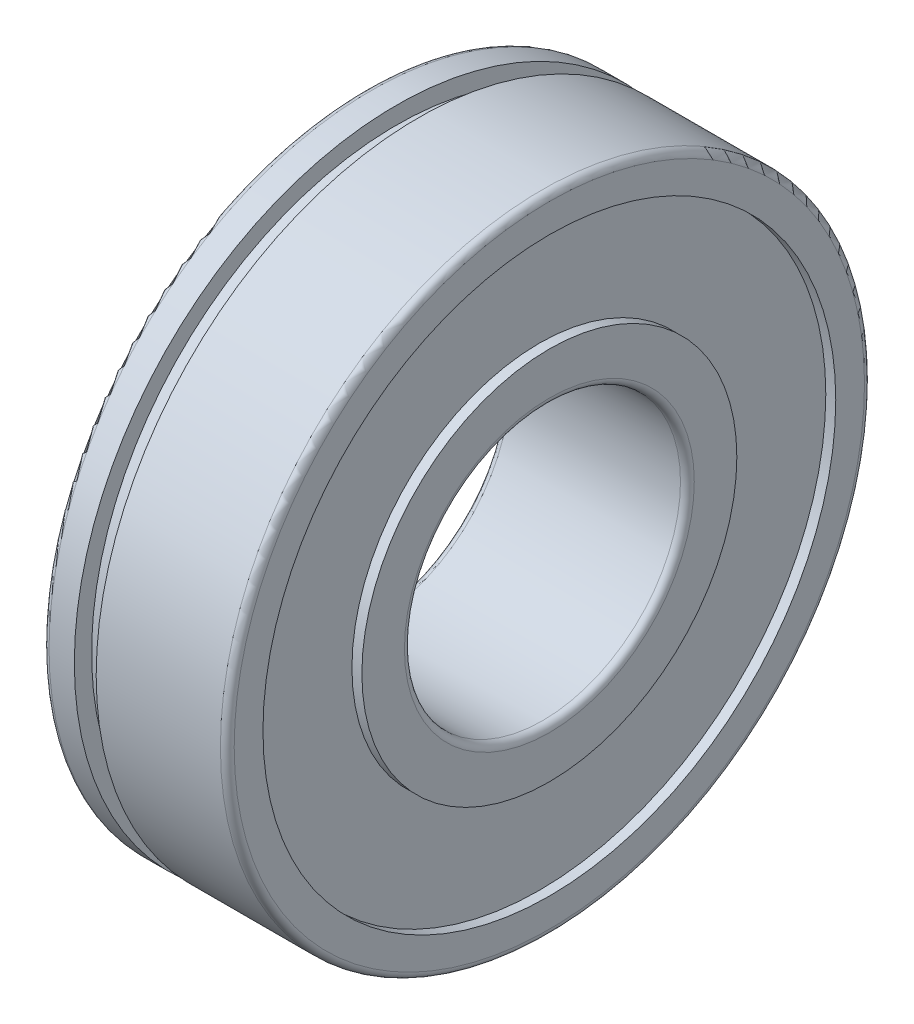
ISO-10303-21;
HEADER;
FILE_DESCRIPTION(('STEP AP214'),'2;1');
FILE_NAME('part.step','',(''),(''),'','','');
FILE_SCHEMA(('AUTOMOTIVE_DESIGN { 1 0 10303 214 1 1 1 1 }'));
ENDSEC;
DATA;
#1=APPLICATION_CONTEXT('core data for automotive mechanical design processes');
#2=APPLICATION_PROTOCOL_DEFINITION('international standard','automotive_design',2000,#1);
#3=PRODUCT_CONTEXT('',#1,'mechanical');
#4=PRODUCT('Part','Part','',(#3));
#5=PRODUCT_RELATED_PRODUCT_CATEGORY('part','',(#4));
#6=PRODUCT_DEFINITION_FORMATION('','',#4);
#7=PRODUCT_DEFINITION_CONTEXT('part definition',#1,'design');
#8=PRODUCT_DEFINITION('design','',#6,#7);
#9=PRODUCT_DEFINITION_SHAPE('','',#8);
#10=(LENGTH_UNIT() NAMED_UNIT(*) SI_UNIT(.MILLI.,.METRE.));
#11=(NAMED_UNIT(*) PLANE_ANGLE_UNIT() SI_UNIT($,.RADIAN.));
#12=(NAMED_UNIT(*) SI_UNIT($,.STERADIAN.) SOLID_ANGLE_UNIT());
#13=UNCERTAINTY_MEASURE_WITH_UNIT(LENGTH_MEASURE(1.E-05),#10,'distance_accuracy_value','');
#14=(GEOMETRIC_REPRESENTATION_CONTEXT(3) GLOBAL_UNCERTAINTY_ASSIGNED_CONTEXT((#13)) GLOBAL_UNIT_ASSIGNED_CONTEXT((#10,
#11,#12)) REPRESENTATION_CONTEXT('',''));
#15=CARTESIAN_POINT('',(0.,0.,0.));
#16=DIRECTION('',(0.,0.,1.));
#17=DIRECTION('',(1.,0.,0.));
#18=AXIS2_PLACEMENT_3D('',#15,#16,#17);
#19=CARTESIAN_POINT('',(0.,13.1000000000001,0.));
#20=DIRECTION('',(-1.,0.,0.));
#21=DIRECTION('',(0.,0.,1.));
#22=AXIS2_PLACEMENT_3D('',#19,#20,#21);
#23=PLANE('',#22);
#24=CARTESIAN_POINT('',(0.,0.,0.));
#25=DIRECTION('',(1.,0.,0.));
#26=DIRECTION('',(0.,0.,1.));
#27=AXIS2_PLACEMENT_3D('',#24,#25,#26);
#28=CIRCLE('',#27,13.7499999999997);
#29=CARTESIAN_POINT('',(0.,2.22044604925031E-13,13.7499999999997));
#30=VERTEX_POINT('',#29);
#31=CARTESIAN_POINT('',(0.,0.,-13.7499999999999));
#32=VERTEX_POINT('',#31);
#33=EDGE_CURVE('E75',#30,#32,#28,.T.);
#34=ORIENTED_EDGE('',*,*,#33,.F.);
#35=CARTESIAN_POINT('',(0.,0.,0.));
#36=DIRECTION('',(1.,0.,0.));
#37=DIRECTION('',(0.,1.,0.));
#38=AXIS2_PLACEMENT_3D('',#35,#36,#37);
#39=CIRCLE('',#38,13.7499999999997);
#40=CARTESIAN_POINT('',(0.,13.7500000000004,-8.88178419700125E-13));
#41=VERTEX_POINT('',#40);
#42=EDGE_CURVE('E68',#41,#30,#39,.T.);
#43=ORIENTED_EDGE('',*,*,#42,.F.);
#44=CARTESIAN_POINT('',(0.,0.,0.));
#45=DIRECTION('',(1.,0.,0.));
#46=DIRECTION('',(0.,0.,-1.));
#47=AXIS2_PLACEMENT_3D('',#44,#45,#46);
#48=CIRCLE('',#47,13.7499999999997);
#49=EDGE_CURVE('E72',#32,#41,#48,.T.);
#50=ORIENTED_EDGE('',*,*,#49,.F.);
#51=EDGE_LOOP('',(#34,#43,#50));
#52=FACE_BOUND('',#51,.T.);
#53=CARTESIAN_POINT('',(0.,0.,0.));
#54=DIRECTION('',(1.,0.,0.));
#55=DIRECTION('',(0.,0.,-1.));
#56=AXIS2_PLACEMENT_3D('',#53,#54,#55);
#57=CIRCLE('',#56,12.45);
#58=CARTESIAN_POINT('',(0.,0.,-12.45));
#59=VERTEX_POINT('',#58);
#60=EDGE_CURVE('E128',#59,#59,#57,.T.);
#61=ORIENTED_EDGE('',*,*,#60,.T.);
#62=EDGE_LOOP('',(#61));
#63=FACE_BOUND('',#62,.T.);
#64=ADVANCED_FACE('F18',(#52,#63),#23,.T.);
#65=CARTESIAN_POINT('',(0.25,0.,0.));
#66=DIRECTION('',(-1.,0.,0.));
#67=DIRECTION('',(0.,0.,1.));
#68=AXIS2_PLACEMENT_3D('',#65,#66,#67);
#69=TOROIDAL_SURFACE('',#68,13.7499999999997,0.249999999999998);
#70=ORIENTED_EDGE('',*,*,#42,.T.);
#71=ORIENTED_EDGE('',*,*,#33,.T.);
#72=ORIENTED_EDGE('',*,*,#49,.T.);
#73=EDGE_LOOP('',(#70,#71,#72));
#74=FACE_BOUND('',#73,.T.);
#75=CARTESIAN_POINT('',(0.25,0.,0.));
#76=DIRECTION('',(1.,0.,0.));
#77=DIRECTION('',(0.,0.,-1.));
#78=AXIS2_PLACEMENT_3D('',#75,#76,#77);
#79=CIRCLE('',#78,14.);
#80=CARTESIAN_POINT('',(0.25,0.,-14.0000000000001));
#81=VERTEX_POINT('',#80);
#82=EDGE_CURVE('E108',#81,#81,#79,.T.);
#83=ORIENTED_EDGE('',*,*,#82,.F.);
#84=EDGE_LOOP('',(#83));
#85=FACE_BOUND('',#84,.T.);
#86=ADVANCED_FACE('F81',(#74,#85),#69,.T.);
#87=CARTESIAN_POINT('',(0.216500000000001,0.,0.));
#88=DIRECTION('',(1.,0.,0.));
#89=DIRECTION('',(0.,0.,-1.));
#90=AXIS2_PLACEMENT_3D('',#87,#88,#89);
#91=CYLINDRICAL_SURFACE('',#90,12.45);
#92=CARTESIAN_POINT('',(0.433000000000003,0.,0.));
#93=DIRECTION('',(1.,0.,0.));
#94=DIRECTION('',(0.,0.,-1.));
#95=AXIS2_PLACEMENT_3D('',#92,#93,#94);
#96=CIRCLE('',#95,12.45);
#97=CARTESIAN_POINT('',(0.433000000000003,0.,-12.45));
#98=VERTEX_POINT('',#97);
#99=EDGE_CURVE('E127',#98,#98,#96,.F.);
#100=ORIENTED_EDGE('',*,*,#99,.F.);
#101=EDGE_LOOP('',(#100));
#102=FACE_BOUND('',#101,.T.);
#103=ORIENTED_EDGE('',*,*,#60,.F.);
#104=EDGE_LOOP('',(#103));
#105=FACE_BOUND('',#104,.T.);
#106=ADVANCED_FACE('F101',(#102,#105),#91,.F.);
#107=CARTESIAN_POINT('',(3.975,0.,0.));
#108=DIRECTION('',(1.,0.,0.));
#109=DIRECTION('',(0.,0.,-1.));
#110=AXIS2_PLACEMENT_3D('',#107,#108,#109);
#111=CYLINDRICAL_SURFACE('',#110,14.);
#112=ORIENTED_EDGE('',*,*,#82,.T.);
#113=EDGE_LOOP('',(#112));
#114=FACE_BOUND('',#113,.T.);
#115=CARTESIAN_POINT('',(1.35,0.,0.));
#116=DIRECTION('',(1.,0.,0.));
#117=DIRECTION('',(0.,0.,-1.));
#118=AXIS2_PLACEMENT_3D('',#115,#116,#117);
#119=CIRCLE('',#118,14.);
#120=CARTESIAN_POINT('',(1.35,0.,-14.0000000000001));
#121=VERTEX_POINT('',#120);
#122=EDGE_CURVE('E227',#121,#121,#119,.F.);
#123=ORIENTED_EDGE('',*,*,#122,.T.);
#124=EDGE_LOOP('',(#123));
#125=FACE_BOUND('',#124,.T.);
#126=ADVANCED_FACE('F537',(#114,#125),#111,.T.);
#127=CARTESIAN_POINT('',(0.433000000000003,10.3000000000002,-8.88178419700125E-13));
#128=DIRECTION('',(-1.,0.,0.));
#129=DIRECTION('',(0.,0.,1.));
#130=AXIS2_PLACEMENT_3D('',#127,#128,#129);
#131=PLANE('',#130);
#132=ORIENTED_EDGE('',*,*,#99,.T.);
#133=EDGE_LOOP('',(#132));
#134=FACE_BOUND('',#133,.T.);
#135=CARTESIAN_POINT('',(0.433000000000003,0.,0.));
#136=DIRECTION('',(1.,0.,0.));
#137=DIRECTION('',(0.,0.,-1.));
#138=AXIS2_PLACEMENT_3D('',#135,#136,#137);
#139=CIRCLE('',#138,8.15);
#140=CARTESIAN_POINT('',(0.433000000000003,0.,-8.15000000000003));
#141=VERTEX_POINT('',#140);
#142=EDGE_CURVE('E224',#141,#141,#139,.F.);
#143=ORIENTED_EDGE('',*,*,#142,.F.);
#144=EDGE_LOOP('',(#143));
#145=FACE_BOUND('',#144,.T.);
#146=ADVANCED_FACE('F528',(#134,#145),#131,.T.);
#147=CARTESIAN_POINT('',(1.35,15.7500000000006,2.22044604925031E-13));
#148=DIRECTION('',(-1.,0.,0.));
#149=DIRECTION('',(0.,0.,1.));
#150=AXIS2_PLACEMENT_3D('',#147,#148,#149);
#151=PLANE('',#150);
#152=CARTESIAN_POINT('',(1.35,0.,0.));
#153=DIRECTION('',(1.,0.,0.));
#154=DIRECTION('',(0.,0.,-1.));
#155=AXIS2_PLACEMENT_3D('',#152,#153,#154);
#156=CIRCLE('',#155,13.25);
#157=CARTESIAN_POINT('',(1.35,0.,-13.25));
#158=VERTEX_POINT('',#157);
#159=EDGE_CURVE('E217',#158,#158,#156,.T.);
#160=ORIENTED_EDGE('',*,*,#159,.F.);
#161=EDGE_LOOP('',(#160));
#162=FACE_BOUND('',#161,.T.);
#163=ORIENTED_EDGE('',*,*,#122,.F.);
#164=EDGE_LOOP('',(#163));
#165=FACE_BOUND('',#164,.T.);
#166=ADVANCED_FACE('F520',(#162,#165),#151,.F.);
#167=CARTESIAN_POINT('',(0.216500000000001,0.,0.));
#168=DIRECTION('',(1.,0.,0.));
#169=DIRECTION('',(0.,0.,-1.));
#170=AXIS2_PLACEMENT_3D('',#167,#168,#169);
#171=CYLINDRICAL_SURFACE('',#170,8.15);
#172=CARTESIAN_POINT('',(0.,0.,0.));
#173=DIRECTION('',(1.,0.,0.));
#174=DIRECTION('',(0.,0.,-1.));
#175=AXIS2_PLACEMENT_3D('',#172,#173,#174);
#176=CIRCLE('',#175,8.15);
#177=CARTESIAN_POINT('',(0.,0.,-8.15000000000003));
#178=VERTEX_POINT('',#177);
#179=EDGE_CURVE('E212',#178,#178,#176,.F.);
#180=ORIENTED_EDGE('',*,*,#179,.F.);
#181=EDGE_LOOP('',(#180));
#182=FACE_BOUND('',#181,.T.);
#183=ORIENTED_EDGE('',*,*,#142,.T.);
#184=EDGE_LOOP('',(#183));
#185=FACE_BOUND('',#184,.T.);
#186=ADVANCED_FACE('F513',(#182,#185),#171,.T.);
#187=CARTESIAN_POINT('',(1.825,0.,0.));
#188=DIRECTION('',(1.,0.,0.));
#189=DIRECTION('',(0.,0.,-1.));
#190=AXIS2_PLACEMENT_3D('',#187,#188,#189);
#191=CYLINDRICAL_SURFACE('',#190,13.25);
#192=CARTESIAN_POINT('',(2.3,0.,0.));
#193=DIRECTION('',(1.,0.,0.));
#194=DIRECTION('',(0.,0.,-1.));
#195=AXIS2_PLACEMENT_3D('',#192,#193,#194);
#196=CIRCLE('',#195,13.25);
#197=CARTESIAN_POINT('',(2.3,0.,-13.25));
#198=VERTEX_POINT('',#197);
#199=EDGE_CURVE('E210',#198,#198,#196,.F.);
#200=ORIENTED_EDGE('',*,*,#199,.T.);
#201=EDGE_LOOP('',(#200));
#202=FACE_BOUND('',#201,.T.);
#203=ORIENTED_EDGE('',*,*,#159,.T.);
#204=EDGE_LOOP('',(#203));
#205=FACE_BOUND('',#204,.T.);
#206=ADVANCED_FACE('F175',(#202,#205),#191,.T.);
#207=CARTESIAN_POINT('',(0.,7.22500000000026,-5.55111512312578E-13));
#208=DIRECTION('',(-1.,0.,0.));
#209=DIRECTION('',(0.,0.,1.));
#210=AXIS2_PLACEMENT_3D('',#207,#208,#209);
#211=PLANE('',#210);
#212=ORIENTED_EDGE('',*,*,#179,.T.);
#213=EDGE_LOOP('',(#212));
#214=FACE_BOUND('',#213,.T.);
#215=CARTESIAN_POINT('',(0.,0.,0.));
#216=DIRECTION('',(-1.,0.,0.));
#217=DIRECTION('',(0.,0.,1.));
#218=AXIS2_PLACEMENT_3D('',#215,#216,#217);
#219=CIRCLE('',#218,6.29999999999975);
#220=CARTESIAN_POINT('',(0.,2.22044604925031E-13,6.29999999999975));
#221=VERTEX_POINT('',#220);
#222=CARTESIAN_POINT('',(0.,6.30000000000019,-8.88178419700125E-13));
#223=VERTEX_POINT('',#222);
#224=EDGE_CURVE('E206',#221,#223,#219,.T.);
#225=ORIENTED_EDGE('',*,*,#224,.F.);
#226=CARTESIAN_POINT('',(0.,0.,0.));
#227=DIRECTION('',(-1.,0.,0.));
#228=DIRECTION('',(0.,0.,-1.));
#229=AXIS2_PLACEMENT_3D('',#226,#227,#228);
#230=CIRCLE('',#229,6.29999999999975);
#231=CARTESIAN_POINT('',(0.,0.,-6.30000000000086));
#232=VERTEX_POINT('',#231);
#233=EDGE_CURVE('E189',#232,#221,#230,.T.);
#234=ORIENTED_EDGE('',*,*,#233,.F.);
#235=CARTESIAN_POINT('',(0.,0.,0.));
#236=DIRECTION('',(-1.,0.,0.));
#237=DIRECTION('',(0.,1.,0.));
#238=AXIS2_PLACEMENT_3D('',#235,#236,#237);
#239=CIRCLE('',#238,6.29999999999975);
#240=EDGE_CURVE('E161',#223,#232,#239,.T.);
#241=ORIENTED_EDGE('',*,*,#240,.F.);
#242=EDGE_LOOP('',(#225,#234,#241));
#243=FACE_BOUND('',#242,.T.);
#244=ADVANCED_FACE('F166',(#214,#243),#211,.T.);
#245=CARTESIAN_POINT('',(2.3,15.7500000000006,2.22044604925031E-13));
#246=DIRECTION('',(1.,0.,0.));
#247=DIRECTION('',(0.,0.,-1.));
#248=AXIS2_PLACEMENT_3D('',#245,#246,#247);
#249=PLANE('',#248);
#250=ORIENTED_EDGE('',*,*,#199,.F.);
#251=EDGE_LOOP('',(#250));
#252=FACE_BOUND('',#251,.T.);
#253=CARTESIAN_POINT('',(2.3,0.,0.));
#254=DIRECTION('',(1.,0.,0.));
#255=DIRECTION('',(0.,0.,-1.));
#256=AXIS2_PLACEMENT_3D('',#253,#254,#255);
#257=CIRCLE('',#256,14.);
#258=CARTESIAN_POINT('',(2.3,0.,-14.0000000000001));
#259=VERTEX_POINT('',#258);
#260=EDGE_CURVE('E207',#259,#259,#257,.T.);
#261=ORIENTED_EDGE('',*,*,#260,.F.);
#262=EDGE_LOOP('',(#261));
#263=FACE_BOUND('',#262,.T.);
#264=ADVANCED_FACE('F146',(#252,#263),#249,.F.);
#265=CARTESIAN_POINT('',(0.300000000000002,0.,0.));
#266=DIRECTION('',(-1.,0.,0.));
#267=DIRECTION('',(0.,0.,1.));
#268=AXIS2_PLACEMENT_3D('',#265,#266,#267);
#269=TOROIDAL_SURFACE('',#268,6.29999999999975,0.3);
#270=ORIENTED_EDGE('',*,*,#233,.T.);
#271=ORIENTED_EDGE('',*,*,#224,.T.);
#272=ORIENTED_EDGE('',*,*,#240,.T.);
#273=EDGE_LOOP('',(#270,#271,#272));
#274=FACE_BOUND('',#273,.T.);
#275=CARTESIAN_POINT('',(0.300000000000002,0.,0.));
#276=DIRECTION('',(1.,0.,0.));
#277=DIRECTION('',(0.,0.,-1.));
#278=AXIS2_PLACEMENT_3D('',#275,#276,#277);
#279=CIRCLE('',#278,6.);
#280=CARTESIAN_POINT('',(0.300000000000002,0.,-6.00000000000002));
#281=VERTEX_POINT('',#280);
#282=EDGE_CURVE('E155',#281,#281,#279,.T.);
#283=ORIENTED_EDGE('',*,*,#282,.T.);
#284=EDGE_LOOP('',(#283));
#285=FACE_BOUND('',#284,.T.);
#286=ADVANCED_FACE('F134',(#274,#285),#269,.T.);
#287=CARTESIAN_POINT('',(3.975,0.,0.));
#288=DIRECTION('',(1.,0.,0.));
#289=DIRECTION('',(0.,0.,-1.));
#290=AXIS2_PLACEMENT_3D('',#287,#288,#289);
#291=CYLINDRICAL_SURFACE('',#290,14.);
#292=CARTESIAN_POINT('',(7.7,0.,0.));
#293=DIRECTION('',(-1.,0.,0.));
#294=DIRECTION('',(0.,0.,1.));
#295=AXIS2_PLACEMENT_3D('',#292,#293,#294);
#296=CIRCLE('',#295,14.);
#297=CARTESIAN_POINT('',(7.7,0.,14.0000000000001));
#298=VERTEX_POINT('',#297);
#299=EDGE_CURVE('E307',#298,#298,#296,.F.);
#300=ORIENTED_EDGE('',*,*,#299,.F.);
#301=EDGE_LOOP('',(#300));
#302=FACE_BOUND('',#301,.T.);
#303=ORIENTED_EDGE('',*,*,#260,.T.);
#304=EDGE_LOOP('',(#303));
#305=FACE_BOUND('',#304,.T.);
#306=ADVANCED_FACE('F145',(#302,#305),#291,.T.);
#307=CARTESIAN_POINT('',(4.,0.,0.));
#308=DIRECTION('',(1.,0.,0.));
#309=DIRECTION('',(0.,0.,-1.));
#310=AXIS2_PLACEMENT_3D('',#307,#308,#309);
#311=CYLINDRICAL_SURFACE('',#310,6.);
#312=ORIENTED_EDGE('',*,*,#282,.F.);
#313=EDGE_LOOP('',(#312));
#314=FACE_BOUND('',#313,.T.);
#315=CARTESIAN_POINT('',(7.7,0.,0.));
#316=DIRECTION('',(-1.,0.,0.));
#317=DIRECTION('',(0.,0.,1.));
#318=AXIS2_PLACEMENT_3D('',#315,#316,#317);
#319=CIRCLE('',#318,6.);
#320=CARTESIAN_POINT('',(7.7,0.,6.00000000000002));
#321=VERTEX_POINT('',#320);
#322=EDGE_CURVE('E299',#321,#321,#319,.T.);
#323=ORIENTED_EDGE('',*,*,#322,.F.);
#324=EDGE_LOOP('',(#323));
#325=FACE_BOUND('',#324,.T.);
#326=ADVANCED_FACE('F314',(#314,#325),#311,.F.);
#327=CARTESIAN_POINT('',(7.7,0.,0.));
#328=DIRECTION('',(-1.,0.,0.));
#329=DIRECTION('',(0.,0.,1.));
#330=AXIS2_PLACEMENT_3D('',#327,#328,#329);
#331=TOROIDAL_SURFACE('',#330,13.6999999999998,0.300000000000001);
#332=ORIENTED_EDGE('',*,*,#299,.T.);
#333=EDGE_LOOP('',(#332));
#334=FACE_BOUND('',#333,.T.);
#335=CARTESIAN_POINT('',(8.,0.,0.));
#336=DIRECTION('',(-1.,0.,0.));
#337=DIRECTION('',(0.,0.,-1.));
#338=AXIS2_PLACEMENT_3D('',#335,#336,#337);
#339=CIRCLE('',#338,13.6999999999998);
#340=CARTESIAN_POINT('',(8.,0.,13.6999999999998));
#341=VERTEX_POINT('',#340);
#342=CARTESIAN_POINT('',(8.,2.22044604925031E-13,-13.7000000000007));
#343=VERTEX_POINT('',#342);
#344=EDGE_CURVE('E294',#341,#343,#339,.F.);
#345=ORIENTED_EDGE('',*,*,#344,.F.);
#346=CARTESIAN_POINT('',(8.,0.,0.));
#347=DIRECTION('',(-1.,0.,0.));
#348=DIRECTION('',(0.,0.,1.));
#349=AXIS2_PLACEMENT_3D('',#346,#347,#348);
#350=CIRCLE('',#349,13.6999999999998);
#351=CARTESIAN_POINT('',(8.,13.7,-2.22044604925031E-13));
#352=VERTEX_POINT('',#351);
#353=EDGE_CURVE('E373',#352,#341,#350,.F.);
#354=ORIENTED_EDGE('',*,*,#353,.F.);
#355=CARTESIAN_POINT('',(8.,0.,0.));
#356=DIRECTION('',(-1.,0.,0.));
#357=DIRECTION('',(0.,1.,0.));
#358=AXIS2_PLACEMENT_3D('',#355,#356,#357);
#359=CIRCLE('',#358,13.6999999999998);
#360=EDGE_CURVE('E306',#343,#352,#359,.F.);
#361=ORIENTED_EDGE('',*,*,#360,.F.);
#362=EDGE_LOOP('',(#345,#354,#361));
#363=FACE_BOUND('',#362,.T.);
#364=ADVANCED_FACE('F258',(#334,#363),#331,.T.);
#365=CARTESIAN_POINT('',(7.7,0.,0.));
#366=DIRECTION('',(-1.,0.,0.));
#367=DIRECTION('',(0.,0.,1.));
#368=AXIS2_PLACEMENT_3D('',#365,#366,#367);
#369=TOROIDAL_SURFACE('',#368,6.29999999999975,0.3);
#370=ORIENTED_EDGE('',*,*,#322,.T.);
#371=EDGE_LOOP('',(#370));
#372=FACE_BOUND('',#371,.T.);
#373=CARTESIAN_POINT('',(8.,0.,0.));
#374=DIRECTION('',(1.,0.,0.));
#375=DIRECTION('',(0.,0.,-1.));
#376=AXIS2_PLACEMENT_3D('',#373,#374,#375);
#377=CIRCLE('',#376,6.29999999999975);
#378=CARTESIAN_POINT('',(8.,6.30000000000019,-8.88178419700125E-13));
#379=VERTEX_POINT('',#378);
#380=CARTESIAN_POINT('',(8.,0.,-6.30000000000086));
#381=VERTEX_POINT('',#380);
#382=EDGE_CURVE('E281',#379,#381,#377,.F.);
#383=ORIENTED_EDGE('',*,*,#382,.F.);
#384=CARTESIAN_POINT('',(8.,0.,0.));
#385=DIRECTION('',(1.,0.,0.));
#386=DIRECTION('',(0.,1.,0.));
#387=AXIS2_PLACEMENT_3D('',#384,#385,#386);
#388=CIRCLE('',#387,6.29999999999975);
#389=CARTESIAN_POINT('',(8.,2.22044604925031E-13,6.29999999999975));
#390=VERTEX_POINT('',#389);
#391=EDGE_CURVE('E38',#390,#379,#388,.F.);
#392=ORIENTED_EDGE('',*,*,#391,.F.);
#393=CARTESIAN_POINT('',(8.,0.,0.));
#394=DIRECTION('',(1.,0.,0.));
#395=DIRECTION('',(0.,0.,1.));
#396=AXIS2_PLACEMENT_3D('',#393,#394,#395);
#397=CIRCLE('',#396,6.29999999999975);
#398=EDGE_CURVE('E238',#381,#390,#397,.F.);
#399=ORIENTED_EDGE('',*,*,#398,.F.);
#400=EDGE_LOOP('',(#383,#392,#399));
#401=FACE_BOUND('',#400,.T.);
#402=ADVANCED_FACE('F246',(#372,#401),#369,.T.);
#403=CARTESIAN_POINT('',(8.,13.0750000000004,-1.11022302462516E-13));
#404=DIRECTION('',(1.,0.,0.));
#405=DIRECTION('',(0.,0.,-1.));
#406=AXIS2_PLACEMENT_3D('',#403,#404,#405);
#407=PLANE('',#406);
#408=CARTESIAN_POINT('',(8.,0.,0.));
#409=DIRECTION('',(1.,0.,0.));
#410=DIRECTION('',(0.,0.,-1.));
#411=AXIS2_PLACEMENT_3D('',#408,#409,#410);
#412=CIRCLE('',#411,12.45);
#413=CARTESIAN_POINT('',(8.,0.,-12.45));
#414=VERTEX_POINT('',#413);
#415=EDGE_CURVE('E370',#414,#414,#412,.F.);
#416=ORIENTED_EDGE('',*,*,#415,.T.);
#417=EDGE_LOOP('',(#416));
#418=FACE_BOUND('',#417,.T.);
#419=ORIENTED_EDGE('',*,*,#353,.T.);
#420=ORIENTED_EDGE('',*,*,#344,.T.);
#421=ORIENTED_EDGE('',*,*,#360,.T.);
#422=EDGE_LOOP('',(#419,#420,#421));
#423=FACE_BOUND('',#422,.T.);
#424=ADVANCED_FACE('F257',(#418,#423),#407,.T.);
#425=CARTESIAN_POINT('',(8.,7.22500000000026,-5.55111512312578E-13));
#426=DIRECTION('',(1.,0.,0.));
#427=DIRECTION('',(0.,0.,-1.));
#428=AXIS2_PLACEMENT_3D('',#425,#426,#427);
#429=PLANE('',#428);
#430=ORIENTED_EDGE('',*,*,#398,.T.);
#431=ORIENTED_EDGE('',*,*,#391,.T.);
#432=ORIENTED_EDGE('',*,*,#382,.T.);
#433=EDGE_LOOP('',(#430,#431,#432));
#434=FACE_BOUND('',#433,.T.);
#435=CARTESIAN_POINT('',(8.,0.,0.));
#436=DIRECTION('',(1.,0.,0.));
#437=DIRECTION('',(0.,0.,-1.));
#438=AXIS2_PLACEMENT_3D('',#435,#436,#437);
#439=CIRCLE('',#438,8.15);
#440=CARTESIAN_POINT('',(8.,0.,-8.15000000000003));
#441=VERTEX_POINT('',#440);
#442=EDGE_CURVE('E372',#441,#441,#439,.F.);
#443=ORIENTED_EDGE('',*,*,#442,.F.);
#444=EDGE_LOOP('',(#443));
#445=FACE_BOUND('',#444,.T.);
#446=ADVANCED_FACE('F338',(#434,#445),#429,.T.);
#447=CARTESIAN_POINT('',(7.7835,0.,0.));
#448=DIRECTION('',(1.,0.,0.));
#449=DIRECTION('',(0.,0.,-1.));
#450=AXIS2_PLACEMENT_3D('',#447,#448,#449);
#451=CYLINDRICAL_SURFACE('',#450,12.45);
#452=ORIENTED_EDGE('',*,*,#415,.F.);
#453=EDGE_LOOP('',(#452));
#454=FACE_BOUND('',#453,.T.);
#455=CARTESIAN_POINT('',(7.567,0.,0.));
#456=DIRECTION('',(1.,0.,0.));
#457=DIRECTION('',(0.,0.,-1.));
#458=AXIS2_PLACEMENT_3D('',#455,#456,#457);
#459=CIRCLE('',#458,12.45);
#460=CARTESIAN_POINT('',(7.567,0.,-12.45));
#461=VERTEX_POINT('',#460);
#462=EDGE_CURVE('E29',#461,#461,#459,.T.);
#463=ORIENTED_EDGE('',*,*,#462,.F.);
#464=EDGE_LOOP('',(#463));
#465=FACE_BOUND('',#464,.T.);
#466=ADVANCED_FACE('F332',(#454,#465),#451,.F.);
#467=CARTESIAN_POINT('',(7.7835,0.,0.));
#468=DIRECTION('',(1.,0.,0.));
#469=DIRECTION('',(0.,0.,-1.));
#470=AXIS2_PLACEMENT_3D('',#467,#468,#469);
#471=CYLINDRICAL_SURFACE('',#470,8.15);
#472=CARTESIAN_POINT('',(7.567,0.,0.));
#473=DIRECTION('',(1.,0.,0.));
#474=DIRECTION('',(0.,0.,-1.));
#475=AXIS2_PLACEMENT_3D('',#472,#473,#474);
#476=CIRCLE('',#475,8.15);
#477=CARTESIAN_POINT('',(7.567,0.,-8.15000000000003));
#478=VERTEX_POINT('',#477);
#479=EDGE_CURVE('E11',#478,#478,#476,.F.);
#480=ORIENTED_EDGE('',*,*,#479,.F.);
#481=EDGE_LOOP('',(#480));
#482=FACE_BOUND('',#481,.T.);
#483=ORIENTED_EDGE('',*,*,#442,.T.);
#484=EDGE_LOOP('',(#483));
#485=FACE_BOUND('',#484,.T.);
#486=ADVANCED_FACE('F326',(#482,#485),#471,.T.);
#487=CARTESIAN_POINT('',(7.567,10.3000000000002,-8.88178419700125E-13));
#488=DIRECTION('',(1.,0.,0.));
#489=DIRECTION('',(0.,0.,-1.));
#490=AXIS2_PLACEMENT_3D('',#487,#488,#489);
#491=PLANE('',#490);
#492=ORIENTED_EDGE('',*,*,#479,.T.);
#493=EDGE_LOOP('',(#492));
#494=FACE_BOUND('',#493,.T.);
#495=ORIENTED_EDGE('',*,*,#462,.T.);
#496=EDGE_LOOP('',(#495));
#497=FACE_BOUND('',#496,.T.);
#498=ADVANCED_FACE('F324',(#494,#497),#491,.T.);
#499=CLOSED_SHELL('',(#64,#86,#106,#126,#146,#166,#186,#206,#244,#264,#286,#306,#326,#364,#402,
#424,#446,#466,#486,#498));
#500=MANIFOLD_SOLID_BREP('B1',#499);
#501=ADVANCED_BREP_SHAPE_REPRESENTATION('',(#18,#500),#14);
#502=SHAPE_DEFINITION_REPRESENTATION(#9,#501);
ENDSEC;
END-ISO-10303-21;
